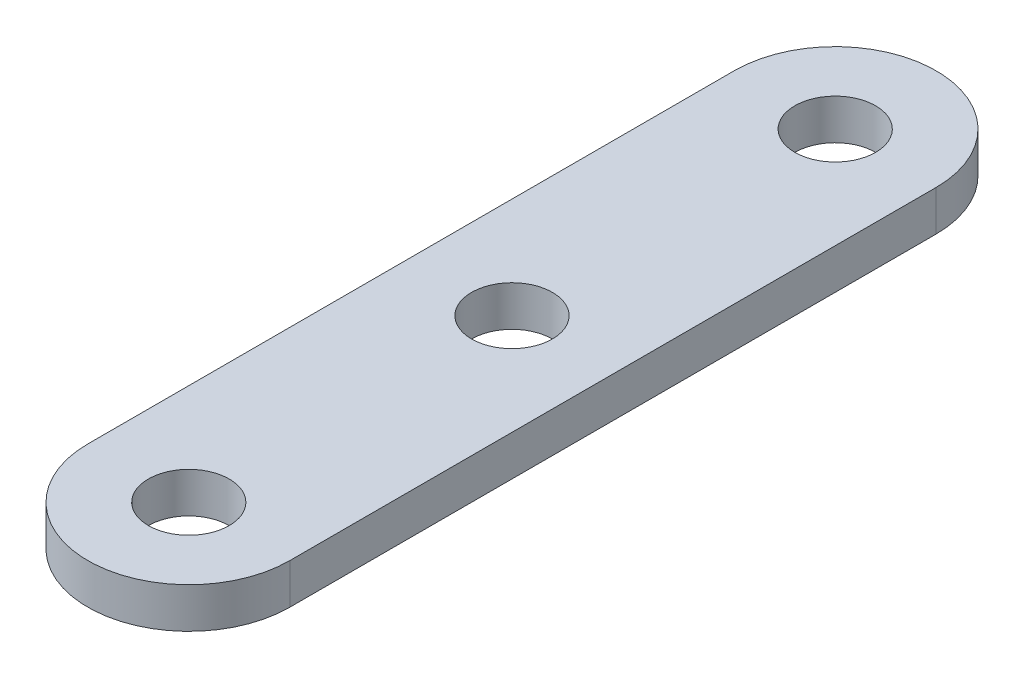
ISO-10303-21;
HEADER;
FILE_DESCRIPTION(('STEP AP214'),'2;1');
FILE_NAME('part.step','',(''),(''),'','','');
FILE_SCHEMA(('AUTOMOTIVE_DESIGN { 1 0 10303 214 1 1 1 1 }'));
ENDSEC;
DATA;
#1=APPLICATION_CONTEXT('core data for automotive mechanical design processes');
#2=APPLICATION_PROTOCOL_DEFINITION('international standard','automotive_design',2000,#1);
#3=PRODUCT_CONTEXT('',#1,'mechanical');
#4=PRODUCT('Part','Part','',(#3));
#5=PRODUCT_RELATED_PRODUCT_CATEGORY('part','',(#4));
#6=PRODUCT_DEFINITION_FORMATION('','',#4);
#7=PRODUCT_DEFINITION_CONTEXT('part definition',#1,'design');
#8=PRODUCT_DEFINITION('design','',#6,#7);
#9=PRODUCT_DEFINITION_SHAPE('','',#8);
#10=(LENGTH_UNIT() NAMED_UNIT(*) SI_UNIT(.MILLI.,.METRE.));
#11=(NAMED_UNIT(*) PLANE_ANGLE_UNIT() SI_UNIT($,.RADIAN.));
#12=(NAMED_UNIT(*) SI_UNIT($,.STERADIAN.) SOLID_ANGLE_UNIT());
#13=UNCERTAINTY_MEASURE_WITH_UNIT(LENGTH_MEASURE(1.E-05),#10,'distance_accuracy_value','');
#14=(GEOMETRIC_REPRESENTATION_CONTEXT(3) GLOBAL_UNCERTAINTY_ASSIGNED_CONTEXT((#13)) GLOBAL_UNIT_ASSIGNED_CONTEXT((#10,
#11,#12)) REPRESENTATION_CONTEXT('',''));
#15=CARTESIAN_POINT('',(0.,0.,0.));
#16=DIRECTION('',(0.,0.,1.));
#17=DIRECTION('',(1.,0.,0.));
#18=AXIS2_PLACEMENT_3D('',#15,#16,#17);
#19=CARTESIAN_POINT('',(-7.9375,3.175,0.));
#20=DIRECTION('',(1.,0.,0.));
#21=DIRECTION('',(0.,0.,-1.));
#22=AXIS2_PLACEMENT_3D('',#19,#20,#21);
#23=PLANE('',#22);
#24=DIRECTION('',(0.,0.,1.));
#25=VECTOR('',#24,1.);
#26=CARTESIAN_POINT('',(-7.9375,0.,0.));
#27=LINE('',#26,#25);
#28=CARTESIAN_POINT('',(-7.9375,0.,-50.8));
#29=VERTEX_POINT('',#28);
#30=CARTESIAN_POINT('',(-7.9375,0.,0.));
#31=VERTEX_POINT('',#30);
#32=EDGE_CURVE('E108',#29,#31,#27,.T.);
#33=ORIENTED_EDGE('',*,*,#32,.T.);
#34=DIRECTION('',(0.,-1.,0.));
#35=VECTOR('',#34,1.);
#36=CARTESIAN_POINT('',(-7.9375,3.175,0.));
#37=LINE('',#36,#35);
#38=CARTESIAN_POINT('',(-7.9375,3.175,0.));
#39=VERTEX_POINT('',#38);
#40=EDGE_CURVE('E11',#39,#31,#37,.T.);
#41=ORIENTED_EDGE('',*,*,#40,.F.);
#42=DIRECTION('',(0.,0.,1.));
#43=VECTOR('',#42,1.);
#44=CARTESIAN_POINT('',(-7.9375,3.175,0.));
#45=LINE('',#44,#43);
#46=CARTESIAN_POINT('',(-7.9375,3.175,-50.8));
#47=VERTEX_POINT('',#46);
#48=EDGE_CURVE('E84',#47,#39,#45,.T.);
#49=ORIENTED_EDGE('',*,*,#48,.F.);
#50=DIRECTION('',(0.,-1.,0.));
#51=VECTOR('',#50,1.);
#52=CARTESIAN_POINT('',(-7.9375,3.175,-50.8));
#53=LINE('',#52,#51);
#54=EDGE_CURVE('E107',#47,#29,#53,.T.);
#55=ORIENTED_EDGE('',*,*,#54,.T.);
#56=EDGE_LOOP('',(#33,#41,#49,#55));
#57=FACE_BOUND('',#56,.T.);
#58=ADVANCED_FACE('F36',(#57),#23,.F.);
#59=CARTESIAN_POINT('',(0.,3.175,0.));
#60=DIRECTION('',(0.,-1.,0.));
#61=DIRECTION('',(0.,0.,-1.));
#62=AXIS2_PLACEMENT_3D('',#59,#60,#61);
#63=CYLINDRICAL_SURFACE('',#62,7.9375);
#64=CARTESIAN_POINT('',(0.,0.,0.));
#65=DIRECTION('',(0.,1.,0.));
#66=DIRECTION('',(0.,0.,1.));
#67=AXIS2_PLACEMENT_3D('',#64,#65,#66);
#68=CIRCLE('',#67,7.9375);
#69=CARTESIAN_POINT('',(7.9375,0.,0.));
#70=VERTEX_POINT('',#69);
#71=EDGE_CURVE('E89',#31,#70,#68,.T.);
#72=ORIENTED_EDGE('',*,*,#71,.T.);
#73=DIRECTION('',(0.,-1.,0.));
#74=VECTOR('',#73,1.);
#75=CARTESIAN_POINT('',(7.9375,3.175,0.));
#76=LINE('',#75,#74);
#77=CARTESIAN_POINT('',(7.9375,3.175,0.));
#78=VERTEX_POINT('',#77);
#79=EDGE_CURVE('E44',#78,#70,#76,.T.);
#80=ORIENTED_EDGE('',*,*,#79,.F.);
#81=CARTESIAN_POINT('',(0.,3.175,0.));
#82=DIRECTION('',(0.,1.,0.));
#83=DIRECTION('',(0.,0.,1.));
#84=AXIS2_PLACEMENT_3D('',#81,#82,#83);
#85=CIRCLE('',#84,7.9375);
#86=EDGE_CURVE('E78',#39,#78,#85,.T.);
#87=ORIENTED_EDGE('',*,*,#86,.F.);
#88=ORIENTED_EDGE('',*,*,#40,.T.);
#89=EDGE_LOOP('',(#72,#80,#87,#88));
#90=FACE_BOUND('',#89,.T.);
#91=ADVANCED_FACE('F88',(#90),#63,.T.);
#92=CARTESIAN_POINT('',(7.9375,3.175,0.));
#93=DIRECTION('',(1.,0.,0.));
#94=DIRECTION('',(0.,0.,-1.));
#95=AXIS2_PLACEMENT_3D('',#92,#93,#94);
#96=PLANE('',#95);
#97=DIRECTION('',(0.,0.,1.));
#98=VECTOR('',#97,1.);
#99=CARTESIAN_POINT('',(7.9375,0.,0.));
#100=LINE('',#99,#98);
#101=CARTESIAN_POINT('',(7.9375,0.,-50.8));
#102=VERTEX_POINT('',#101);
#103=EDGE_CURVE('E112',#102,#70,#100,.T.);
#104=ORIENTED_EDGE('',*,*,#103,.F.);
#105=DIRECTION('',(0.,-1.,0.));
#106=VECTOR('',#105,1.);
#107=CARTESIAN_POINT('',(7.9375,3.175,-50.8));
#108=LINE('',#107,#106);
#109=CARTESIAN_POINT('',(7.9375,3.175,-50.8));
#110=VERTEX_POINT('',#109);
#111=EDGE_CURVE('E68',#110,#102,#108,.T.);
#112=ORIENTED_EDGE('',*,*,#111,.F.);
#113=DIRECTION('',(0.,0.,1.));
#114=VECTOR('',#113,1.);
#115=CARTESIAN_POINT('',(7.9375,3.175,0.));
#116=LINE('',#115,#114);
#117=EDGE_CURVE('E82',#110,#78,#116,.T.);
#118=ORIENTED_EDGE('',*,*,#117,.T.);
#119=ORIENTED_EDGE('',*,*,#79,.T.);
#120=EDGE_LOOP('',(#104,#112,#118,#119));
#121=FACE_BOUND('',#120,.T.);
#122=ADVANCED_FACE('F93',(#121),#96,.T.);
#123=CARTESIAN_POINT('',(0.,3.175,-50.8));
#124=DIRECTION('',(0.,-1.,0.));
#125=DIRECTION('',(0.,0.,-1.));
#126=AXIS2_PLACEMENT_3D('',#123,#124,#125);
#127=CYLINDRICAL_SURFACE('',#126,3.175);
#128=CARTESIAN_POINT('',(0.,3.175,-50.8));
#129=DIRECTION('',(0.,1.,0.));
#130=DIRECTION('',(0.,0.,1.));
#131=AXIS2_PLACEMENT_3D('',#128,#129,#130);
#132=CIRCLE('',#131,3.175);
#133=CARTESIAN_POINT('',(0.,3.175,-47.625));
#134=VERTEX_POINT('',#133);
#135=EDGE_CURVE('E101',#134,#134,#132,.T.);
#136=ORIENTED_EDGE('',*,*,#135,.T.);
#137=EDGE_LOOP('',(#136));
#138=FACE_BOUND('',#137,.T.);
#139=CARTESIAN_POINT('',(0.,0.,-50.8));
#140=DIRECTION('',(0.,1.,0.));
#141=DIRECTION('',(0.,0.,1.));
#142=AXIS2_PLACEMENT_3D('',#139,#140,#141);
#143=CIRCLE('',#142,3.175);
#144=CARTESIAN_POINT('',(0.,0.,-47.625));
#145=VERTEX_POINT('',#144);
#146=EDGE_CURVE('E118',#145,#145,#143,.T.);
#147=ORIENTED_EDGE('',*,*,#146,.F.);
#148=EDGE_LOOP('',(#147));
#149=FACE_BOUND('',#148,.T.);
#150=ADVANCED_FACE('F158',(#138,#149),#127,.F.);
#151=CARTESIAN_POINT('',(0.,3.175,-25.4));
#152=DIRECTION('',(0.,-1.,0.));
#153=DIRECTION('',(0.,0.,-1.));
#154=AXIS2_PLACEMENT_3D('',#151,#152,#153);
#155=CYLINDRICAL_SURFACE('',#154,3.175);
#156=CARTESIAN_POINT('',(0.,3.175,-25.4));
#157=DIRECTION('',(0.,1.,0.));
#158=DIRECTION('',(0.,0.,1.));
#159=AXIS2_PLACEMENT_3D('',#156,#157,#158);
#160=CIRCLE('',#159,3.175);
#161=CARTESIAN_POINT('',(0.,3.175,-22.225));
#162=VERTEX_POINT('',#161);
#163=EDGE_CURVE('E95',#162,#162,#160,.T.);
#164=ORIENTED_EDGE('',*,*,#163,.T.);
#165=EDGE_LOOP('',(#164));
#166=FACE_BOUND('',#165,.T.);
#167=CARTESIAN_POINT('',(0.,0.,-25.4));
#168=DIRECTION('',(0.,1.,0.));
#169=DIRECTION('',(0.,0.,1.));
#170=AXIS2_PLACEMENT_3D('',#167,#168,#169);
#171=CIRCLE('',#170,3.175);
#172=CARTESIAN_POINT('',(0.,0.,-22.225));
#173=VERTEX_POINT('',#172);
#174=EDGE_CURVE('E115',#173,#173,#171,.T.);
#175=ORIENTED_EDGE('',*,*,#174,.F.);
#176=EDGE_LOOP('',(#175));
#177=FACE_BOUND('',#176,.T.);
#178=ADVANCED_FACE('F148',(#166,#177),#155,.F.);
#179=CARTESIAN_POINT('',(0.,3.175,-50.8));
#180=DIRECTION('',(0.,-1.,0.));
#181=DIRECTION('',(0.,0.,-1.));
#182=AXIS2_PLACEMENT_3D('',#179,#180,#181);
#183=CYLINDRICAL_SURFACE('',#182,7.9375);
#184=CARTESIAN_POINT('',(0.,0.,-50.8));
#185=DIRECTION('',(0.,1.,0.));
#186=DIRECTION('',(0.,0.,1.));
#187=AXIS2_PLACEMENT_3D('',#184,#185,#186);
#188=CIRCLE('',#187,7.9375);
#189=EDGE_CURVE('E71',#102,#29,#188,.T.);
#190=ORIENTED_EDGE('',*,*,#189,.T.);
#191=ORIENTED_EDGE('',*,*,#54,.F.);
#192=CARTESIAN_POINT('',(0.,3.175,-50.8));
#193=DIRECTION('',(0.,1.,0.));
#194=DIRECTION('',(0.,0.,1.));
#195=AXIS2_PLACEMENT_3D('',#192,#193,#194);
#196=CIRCLE('',#195,7.9375);
#197=EDGE_CURVE('E52',#110,#47,#196,.T.);
#198=ORIENTED_EDGE('',*,*,#197,.F.);
#199=ORIENTED_EDGE('',*,*,#111,.T.);
#200=EDGE_LOOP('',(#190,#191,#198,#199));
#201=FACE_BOUND('',#200,.T.);
#202=ADVANCED_FACE('F140',(#201),#183,.T.);
#203=CARTESIAN_POINT('',(0.,3.175,0.));
#204=DIRECTION('',(0.,-1.,0.));
#205=DIRECTION('',(0.,0.,-1.));
#206=AXIS2_PLACEMENT_3D('',#203,#204,#205);
#207=CYLINDRICAL_SURFACE('',#206,3.175);
#208=CARTESIAN_POINT('',(0.,3.175,0.));
#209=DIRECTION('',(0.,1.,0.));
#210=DIRECTION('',(0.,0.,1.));
#211=AXIS2_PLACEMENT_3D('',#208,#209,#210);
#212=CIRCLE('',#211,3.175);
#213=CARTESIAN_POINT('',(0.,3.175,3.175));
#214=VERTEX_POINT('',#213);
#215=EDGE_CURVE('E104',#214,#214,#212,.T.);
#216=ORIENTED_EDGE('',*,*,#215,.T.);
#217=EDGE_LOOP('',(#216));
#218=FACE_BOUND('',#217,.T.);
#219=CARTESIAN_POINT('',(0.,0.,0.));
#220=DIRECTION('',(0.,1.,0.));
#221=DIRECTION('',(0.,0.,1.));
#222=AXIS2_PLACEMENT_3D('',#219,#220,#221);
#223=CIRCLE('',#222,3.175);
#224=CARTESIAN_POINT('',(0.,0.,3.175));
#225=VERTEX_POINT('',#224);
#226=EDGE_CURVE('E121',#225,#225,#223,.T.);
#227=ORIENTED_EDGE('',*,*,#226,.F.);
#228=EDGE_LOOP('',(#227));
#229=FACE_BOUND('',#228,.T.);
#230=ADVANCED_FACE('F138',(#218,#229),#207,.F.);
#231=CARTESIAN_POINT('',(0.,3.175,0.));
#232=DIRECTION('',(0.,1.,0.));
#233=DIRECTION('',(0.,0.,1.));
#234=AXIS2_PLACEMENT_3D('',#231,#232,#233);
#235=PLANE('',#234);
#236=ORIENTED_EDGE('',*,*,#48,.T.);
#237=ORIENTED_EDGE('',*,*,#86,.T.);
#238=ORIENTED_EDGE('',*,*,#117,.F.);
#239=ORIENTED_EDGE('',*,*,#197,.T.);
#240=EDGE_LOOP('',(#236,#237,#238,#239));
#241=FACE_BOUND('',#240,.T.);
#242=ORIENTED_EDGE('',*,*,#163,.F.);
#243=EDGE_LOOP('',(#242));
#244=FACE_BOUND('',#243,.T.);
#245=ORIENTED_EDGE('',*,*,#135,.F.);
#246=EDGE_LOOP('',(#245));
#247=FACE_BOUND('',#246,.T.);
#248=ORIENTED_EDGE('',*,*,#215,.F.);
#249=EDGE_LOOP('',(#248));
#250=FACE_BOUND('',#249,.T.);
#251=ADVANCED_FACE('F79',(#241,#244,#247,#250),#235,.T.);
#252=CARTESIAN_POINT('',(0.,0.,0.));
#253=DIRECTION('',(0.,1.,0.));
#254=DIRECTION('',(0.,0.,1.));
#255=AXIS2_PLACEMENT_3D('',#252,#253,#254);
#256=PLANE('',#255);
#257=ORIENTED_EDGE('',*,*,#32,.F.);
#258=ORIENTED_EDGE('',*,*,#189,.F.);
#259=ORIENTED_EDGE('',*,*,#103,.T.);
#260=ORIENTED_EDGE('',*,*,#71,.F.);
#261=EDGE_LOOP('',(#257,#258,#259,#260));
#262=FACE_BOUND('',#261,.T.);
#263=ORIENTED_EDGE('',*,*,#174,.T.);
#264=EDGE_LOOP('',(#263));
#265=FACE_BOUND('',#264,.T.);
#266=ORIENTED_EDGE('',*,*,#146,.T.);
#267=EDGE_LOOP('',(#266));
#268=FACE_BOUND('',#267,.T.);
#269=ORIENTED_EDGE('',*,*,#226,.T.);
#270=EDGE_LOOP('',(#269));
#271=FACE_BOUND('',#270,.T.);
#272=ADVANCED_FACE('F128',(#262,#265,#268,#271),#256,.F.);
#273=CLOSED_SHELL('',(#58,#91,#122,#150,#178,#202,#230,#251,#272));
#274=MANIFOLD_SOLID_BREP('B2',#273);
#275=ADVANCED_BREP_SHAPE_REPRESENTATION('',(#18,#274),#14);
#276=SHAPE_DEFINITION_REPRESENTATION(#9,#275);
ENDSEC;
END-ISO-10303-21;
